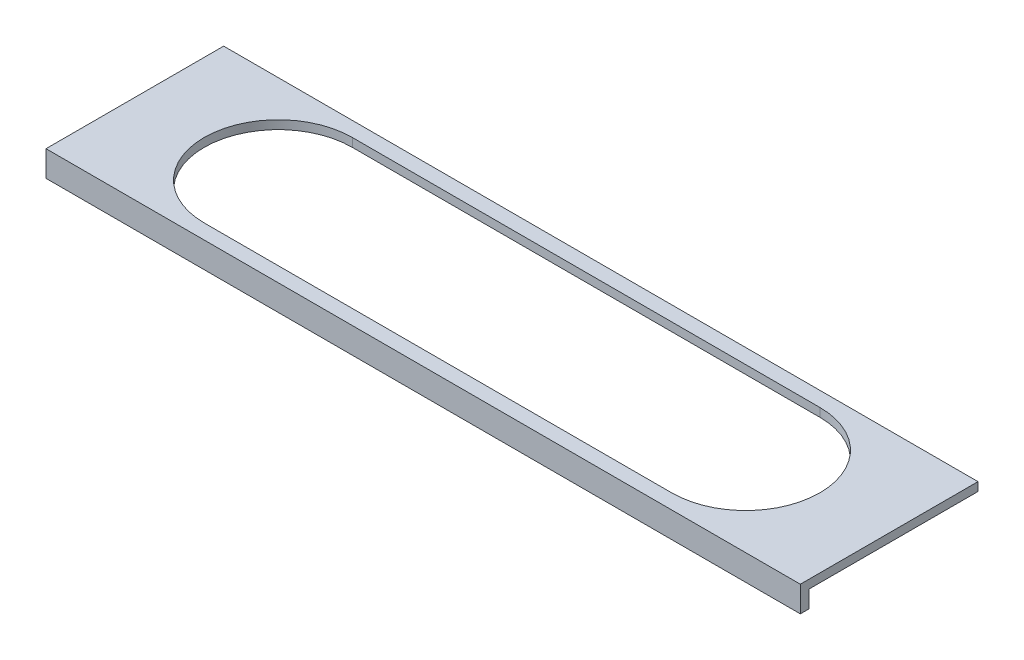
ISO-10303-21;
HEADER;
FILE_DESCRIPTION(('STEP AP214'),'2;1');
FILE_NAME('part.step','',(''),(''),'','','');
FILE_SCHEMA(('AUTOMOTIVE_DESIGN { 1 0 10303 214 1 1 1 1 }'));
ENDSEC;
DATA;
#1=APPLICATION_CONTEXT('core data for automotive mechanical design processes');
#2=APPLICATION_PROTOCOL_DEFINITION('international standard','automotive_design',2000,#1);
#3=PRODUCT_CONTEXT('',#1,'mechanical');
#4=PRODUCT('Part','Part','',(#3));
#5=PRODUCT_RELATED_PRODUCT_CATEGORY('part','',(#4));
#6=PRODUCT_DEFINITION_FORMATION('','',#4);
#7=PRODUCT_DEFINITION_CONTEXT('part definition',#1,'design');
#8=PRODUCT_DEFINITION('design','',#6,#7);
#9=PRODUCT_DEFINITION_SHAPE('','',#8);
#10=(LENGTH_UNIT() NAMED_UNIT(*) SI_UNIT(.MILLI.,.METRE.));
#11=(NAMED_UNIT(*) PLANE_ANGLE_UNIT() SI_UNIT($,.RADIAN.));
#12=(NAMED_UNIT(*) SI_UNIT($,.STERADIAN.) SOLID_ANGLE_UNIT());
#13=UNCERTAINTY_MEASURE_WITH_UNIT(LENGTH_MEASURE(1.E-05),#10,'distance_accuracy_value','');
#14=(GEOMETRIC_REPRESENTATION_CONTEXT(3) GLOBAL_UNCERTAINTY_ASSIGNED_CONTEXT((#13)) GLOBAL_UNIT_ASSIGNED_CONTEXT((#10,
#11,#12)) REPRESENTATION_CONTEXT('',''));
#15=CARTESIAN_POINT('',(0.,0.,0.));
#16=DIRECTION('',(0.,0.,1.));
#17=DIRECTION('',(1.,0.,0.));
#18=AXIS2_PLACEMENT_3D('',#15,#16,#17);
#19=CARTESIAN_POINT('',(0.,0.,0.));
#20=DIRECTION('',(0.,1.,0.));
#21=DIRECTION('',(0.,0.,1.));
#22=AXIS2_PLACEMENT_3D('',#19,#20,#21);
#23=PLANE('',#22);
#24=DIRECTION('',(1.,0.,0.));
#25=VECTOR('',#24,1.);
#26=CARTESIAN_POINT('',(-3000.,0.,949.999999999999));
#27=LINE('',#26,#25);
#28=CARTESIAN_POINT('',(-3000.,0.,949.999999999999));
#29=VERTEX_POINT('',#28);
#30=CARTESIAN_POINT('',(3000.,0.,949.999999999999));
#31=VERTEX_POINT('',#30);
#32=EDGE_CURVE('E173',#29,#31,#27,.T.);
#33=ORIENTED_EDGE('',*,*,#32,.T.);
#34=CARTESIAN_POINT('',(3000.,0.,-7.7715611723761E-13));
#35=DIRECTION('',(0.,1.,0.));
#36=DIRECTION('',(0.,0.,1.));
#37=AXIS2_PLACEMENT_3D('',#34,#35,#36);
#38=CIRCLE('',#37,950.);
#39=CARTESIAN_POINT('',(3000.,0.,-950.));
#40=VERTEX_POINT('',#39);
#41=EDGE_CURVE('E160',#31,#40,#38,.T.);
#42=ORIENTED_EDGE('',*,*,#41,.T.);
#43=DIRECTION('',(-1.,0.,0.));
#44=VECTOR('',#43,1.);
#45=CARTESIAN_POINT('',(-3000.,0.,-950.));
#46=LINE('',#45,#44);
#47=CARTESIAN_POINT('',(-3000.,0.,-950.));
#48=VERTEX_POINT('',#47);
#49=EDGE_CURVE('E164',#40,#48,#46,.T.);
#50=ORIENTED_EDGE('',*,*,#49,.T.);
#51=CARTESIAN_POINT('',(-3000.,0.,-7.7715611723761E-13));
#52=DIRECTION('',(0.,1.,0.));
#53=DIRECTION('',(0.,0.,1.));
#54=AXIS2_PLACEMENT_3D('',#51,#52,#53);
#55=CIRCLE('',#54,950.);
#56=EDGE_CURVE('E169',#48,#29,#55,.T.);
#57=ORIENTED_EDGE('',*,*,#56,.T.);
#58=EDGE_LOOP('',(#33,#42,#50,#57));
#59=FACE_BOUND('',#58,.T.);
#60=DIRECTION('',(1.,0.,0.));
#61=VECTOR('',#60,1.);
#62=CARTESIAN_POINT('',(-4840.,0.,1030.));
#63=LINE('',#62,#61);
#64=CARTESIAN_POINT('',(-4840.,0.,1030.));
#65=VERTEX_POINT('',#64);
#66=CARTESIAN_POINT('',(4840.,0.,1030.));
#67=VERTEX_POINT('',#66);
#68=EDGE_CURVE('E55',#65,#67,#63,.T.);
#69=ORIENTED_EDGE('',*,*,#68,.F.);
#70=DIRECTION('',(0.,0.,1.));
#71=VECTOR('',#70,1.);
#72=CARTESIAN_POINT('',(-4840.,0.,-1140.));
#73=LINE('',#72,#71);
#74=CARTESIAN_POINT('',(-4840.,0.,-1140.));
#75=VERTEX_POINT('',#74);
#76=EDGE_CURVE('E208',#75,#65,#73,.T.);
#77=ORIENTED_EDGE('',*,*,#76,.F.);
#78=DIRECTION('',(-1.,0.,0.));
#79=VECTOR('',#78,1.);
#80=CARTESIAN_POINT('',(-4840.,0.,-1140.));
#81=LINE('',#80,#79);
#82=CARTESIAN_POINT('',(4840.,0.,-1140.));
#83=VERTEX_POINT('',#82);
#84=EDGE_CURVE('E218',#83,#75,#81,.T.);
#85=ORIENTED_EDGE('',*,*,#84,.F.);
#86=DIRECTION('',(0.,0.,-1.));
#87=VECTOR('',#86,1.);
#88=CARTESIAN_POINT('',(4840.,0.,-1140.));
#89=LINE('',#88,#87);
#90=EDGE_CURVE('E194',#67,#83,#89,.T.);
#91=ORIENTED_EDGE('',*,*,#90,.F.);
#92=EDGE_LOOP('',(#69,#77,#85,#91));
#93=FACE_BOUND('',#92,.T.);
#94=ADVANCED_FACE('F39',(#59,#93),#23,.F.);
#95=CARTESIAN_POINT('',(4840.,110.,-1140.));
#96=DIRECTION('',(-1.,0.,0.));
#97=DIRECTION('',(0.,0.,1.));
#98=AXIS2_PLACEMENT_3D('',#95,#96,#97);
#99=PLANE('',#98);
#100=DIRECTION('',(0.,-1.,0.));
#101=VECTOR('',#100,1.);
#102=CARTESIAN_POINT('',(4840.,110.,1140.));
#103=LINE('',#102,#101);
#104=CARTESIAN_POINT('',(4840.,110.,1140.));
#105=VERTEX_POINT('',#104);
#106=CARTESIAN_POINT('',(4840.,-220.,1140.));
#107=VERTEX_POINT('',#106);
#108=EDGE_CURVE('E129',#105,#107,#103,.T.);
#109=ORIENTED_EDGE('',*,*,#108,.T.);
#110=DIRECTION('',(0.,0.,1.));
#111=VECTOR('',#110,1.);
#112=CARTESIAN_POINT('',(4840.,-220.,1030.));
#113=LINE('',#112,#111);
#114=CARTESIAN_POINT('',(4840.,-220.,1030.));
#115=VERTEX_POINT('',#114);
#116=EDGE_CURVE('E144',#115,#107,#113,.T.);
#117=ORIENTED_EDGE('',*,*,#116,.F.);
#118=DIRECTION('',(0.,1.,0.));
#119=VECTOR('',#118,1.);
#120=CARTESIAN_POINT('',(4840.,-220.,1030.));
#121=LINE('',#120,#119);
#122=EDGE_CURVE('E153',#115,#67,#121,.T.);
#123=ORIENTED_EDGE('',*,*,#122,.T.);
#124=ORIENTED_EDGE('',*,*,#90,.T.);
#125=DIRECTION('',(0.,-1.,0.));
#126=VECTOR('',#125,1.);
#127=CARTESIAN_POINT('',(4840.,110.,-1140.));
#128=LINE('',#127,#126);
#129=CARTESIAN_POINT('',(4840.,110.,-1140.));
#130=VERTEX_POINT('',#129);
#131=EDGE_CURVE('E11',#130,#83,#128,.T.);
#132=ORIENTED_EDGE('',*,*,#131,.F.);
#133=DIRECTION('',(0.,0.,-1.));
#134=VECTOR('',#133,1.);
#135=CARTESIAN_POINT('',(4840.,110.,-1140.));
#136=LINE('',#135,#134);
#137=EDGE_CURVE('E203',#105,#130,#136,.T.);
#138=ORIENTED_EDGE('',*,*,#137,.F.);
#139=EDGE_LOOP('',(#109,#117,#123,#124,#132,#138));
#140=FACE_BOUND('',#139,.T.);
#141=ADVANCED_FACE('F41',(#140),#99,.F.);
#142=CARTESIAN_POINT('',(-4840.,110.,-1140.));
#143=DIRECTION('',(0.,0.,1.));
#144=DIRECTION('',(1.,0.,0.));
#145=AXIS2_PLACEMENT_3D('',#142,#143,#144);
#146=PLANE('',#145);
#147=ORIENTED_EDGE('',*,*,#84,.T.);
#148=DIRECTION('',(0.,-1.,0.));
#149=VECTOR('',#148,1.);
#150=CARTESIAN_POINT('',(-4840.,110.,-1140.));
#151=LINE('',#150,#149);
#152=CARTESIAN_POINT('',(-4840.,110.,-1140.));
#153=VERTEX_POINT('',#152);
#154=EDGE_CURVE('E48',#153,#75,#151,.T.);
#155=ORIENTED_EDGE('',*,*,#154,.F.);
#156=DIRECTION('',(-1.,0.,0.));
#157=VECTOR('',#156,1.);
#158=CARTESIAN_POINT('',(-4840.,110.,-1140.));
#159=LINE('',#158,#157);
#160=EDGE_CURVE('E207',#130,#153,#159,.T.);
#161=ORIENTED_EDGE('',*,*,#160,.F.);
#162=ORIENTED_EDGE('',*,*,#131,.T.);
#163=EDGE_LOOP('',(#147,#155,#161,#162));
#164=FACE_BOUND('',#163,.T.);
#165=ADVANCED_FACE('F230',(#164),#146,.F.);
#166=CARTESIAN_POINT('',(-4840.,110.,-1140.));
#167=DIRECTION('',(1.,0.,0.));
#168=DIRECTION('',(0.,0.,-1.));
#169=AXIS2_PLACEMENT_3D('',#166,#167,#168);
#170=PLANE('',#169);
#171=ORIENTED_EDGE('',*,*,#76,.T.);
#172=DIRECTION('',(0.,1.,0.));
#173=VECTOR('',#172,1.);
#174=CARTESIAN_POINT('',(-4840.,-220.,1030.));
#175=LINE('',#174,#173);
#176=CARTESIAN_POINT('',(-4840.,-220.,1030.));
#177=VERTEX_POINT('',#176);
#178=EDGE_CURVE('E135',#177,#65,#175,.T.);
#179=ORIENTED_EDGE('',*,*,#178,.F.);
#180=DIRECTION('',(0.,0.,-1.));
#181=VECTOR('',#180,1.);
#182=CARTESIAN_POINT('',(-4840.,-220.,1140.));
#183=LINE('',#182,#181);
#184=CARTESIAN_POINT('',(-4840.,-220.,1140.));
#185=VERTEX_POINT('',#184);
#186=EDGE_CURVE('E132',#185,#177,#183,.T.);
#187=ORIENTED_EDGE('',*,*,#186,.F.);
#188=DIRECTION('',(0.,-1.,0.));
#189=VECTOR('',#188,1.);
#190=CARTESIAN_POINT('',(-4840.,110.,1140.));
#191=LINE('',#190,#189);
#192=CARTESIAN_POINT('',(-4840.,110.,1140.));
#193=VERTEX_POINT('',#192);
#194=EDGE_CURVE('E119',#193,#185,#191,.T.);
#195=ORIENTED_EDGE('',*,*,#194,.F.);
#196=DIRECTION('',(0.,0.,1.));
#197=VECTOR('',#196,1.);
#198=CARTESIAN_POINT('',(-4840.,110.,-1140.));
#199=LINE('',#198,#197);
#200=EDGE_CURVE('E211',#153,#193,#199,.T.);
#201=ORIENTED_EDGE('',*,*,#200,.F.);
#202=ORIENTED_EDGE('',*,*,#154,.T.);
#203=EDGE_LOOP('',(#171,#179,#187,#195,#201,#202));
#204=FACE_BOUND('',#203,.T.);
#205=ADVANCED_FACE('F133',(#204),#170,.F.);
#206=CARTESIAN_POINT('',(-4840.,110.,1140.));
#207=DIRECTION('',(0.,0.,-1.));
#208=DIRECTION('',(-1.,0.,0.));
#209=AXIS2_PLACEMENT_3D('',#206,#207,#208);
#210=PLANE('',#209);
#211=ORIENTED_EDGE('',*,*,#194,.T.);
#212=DIRECTION('',(-1.,0.,0.));
#213=VECTOR('',#212,1.);
#214=CARTESIAN_POINT('',(4840.,-220.,1140.));
#215=LINE('',#214,#213);
#216=EDGE_CURVE('E124',#107,#185,#215,.T.);
#217=ORIENTED_EDGE('',*,*,#216,.F.);
#218=ORIENTED_EDGE('',*,*,#108,.F.);
#219=DIRECTION('',(1.,0.,0.));
#220=VECTOR('',#219,1.);
#221=CARTESIAN_POINT('',(-4840.,110.,1140.));
#222=LINE('',#221,#220);
#223=EDGE_CURVE('E125',#193,#105,#222,.T.);
#224=ORIENTED_EDGE('',*,*,#223,.F.);
#225=EDGE_LOOP('',(#211,#217,#218,#224));
#226=FACE_BOUND('',#225,.T.);
#227=ADVANCED_FACE('F121',(#226),#210,.F.);
#228=CARTESIAN_POINT('',(0.,110.,0.));
#229=DIRECTION('',(0.,1.,0.));
#230=DIRECTION('',(0.,0.,1.));
#231=AXIS2_PLACEMENT_3D('',#228,#229,#230);
#232=PLANE('',#231);
#233=CARTESIAN_POINT('',(3000.,110.,-7.7715611723761E-13));
#234=DIRECTION('',(0.,1.,0.));
#235=DIRECTION('',(0.,0.,1.));
#236=AXIS2_PLACEMENT_3D('',#233,#234,#235);
#237=CIRCLE('',#236,950.);
#238=CARTESIAN_POINT('',(3000.,110.,949.999999999999));
#239=VERTEX_POINT('',#238);
#240=CARTESIAN_POINT('',(3000.,110.,-950.));
#241=VERTEX_POINT('',#240);
#242=EDGE_CURVE('E63',#239,#241,#237,.T.);
#243=ORIENTED_EDGE('',*,*,#242,.F.);
#244=DIRECTION('',(1.,0.,0.));
#245=VECTOR('',#244,1.);
#246=CARTESIAN_POINT('',(-3000.,110.,949.999999999999));
#247=LINE('',#246,#245);
#248=CARTESIAN_POINT('',(-3000.,110.,949.999999999999));
#249=VERTEX_POINT('',#248);
#250=EDGE_CURVE('E165',#249,#239,#247,.T.);
#251=ORIENTED_EDGE('',*,*,#250,.F.);
#252=CARTESIAN_POINT('',(-3000.,110.,-7.7715611723761E-13));
#253=DIRECTION('',(0.,1.,0.));
#254=DIRECTION('',(0.,0.,1.));
#255=AXIS2_PLACEMENT_3D('',#252,#253,#254);
#256=CIRCLE('',#255,950.);
#257=CARTESIAN_POINT('',(-3000.,110.,-950.000000000001));
#258=VERTEX_POINT('',#257);
#259=EDGE_CURVE('E184',#258,#249,#256,.T.);
#260=ORIENTED_EDGE('',*,*,#259,.F.);
#261=DIRECTION('',(-1.,0.,0.));
#262=VECTOR('',#261,1.);
#263=CARTESIAN_POINT('',(-3000.,110.,-950.));
#264=LINE('',#263,#262);
#265=EDGE_CURVE('E180',#241,#258,#264,.T.);
#266=ORIENTED_EDGE('',*,*,#265,.F.);
#267=EDGE_LOOP('',(#243,#251,#260,#266));
#268=FACE_BOUND('',#267,.T.);
#269=ORIENTED_EDGE('',*,*,#137,.T.);
#270=ORIENTED_EDGE('',*,*,#160,.T.);
#271=ORIENTED_EDGE('',*,*,#200,.T.);
#272=ORIENTED_EDGE('',*,*,#223,.T.);
#273=EDGE_LOOP('',(#269,#270,#271,#272));
#274=FACE_BOUND('',#273,.T.);
#275=ADVANCED_FACE('F256',(#268,#274),#232,.T.);
#276=CARTESIAN_POINT('',(3000.,0.,-7.7715611723761E-13));
#277=DIRECTION('',(0.,1.,0.));
#278=DIRECTION('',(0.,0.,1.));
#279=AXIS2_PLACEMENT_3D('',#276,#277,#278);
#280=CYLINDRICAL_SURFACE('',#279,950.);
#281=ORIENTED_EDGE('',*,*,#242,.T.);
#282=DIRECTION('',(0.,1.,0.));
#283=VECTOR('',#282,1.);
#284=CARTESIAN_POINT('',(3000.,0.,-950.));
#285=LINE('',#284,#283);
#286=EDGE_CURVE('E177',#40,#241,#285,.T.);
#287=ORIENTED_EDGE('',*,*,#286,.F.);
#288=ORIENTED_EDGE('',*,*,#41,.F.);
#289=DIRECTION('',(0.,1.,0.));
#290=VECTOR('',#289,1.);
#291=CARTESIAN_POINT('',(3000.,0.,949.999999999999));
#292=LINE('',#291,#290);
#293=EDGE_CURVE('E191',#31,#239,#292,.T.);
#294=ORIENTED_EDGE('',*,*,#293,.T.);
#295=EDGE_LOOP('',(#281,#287,#288,#294));
#296=FACE_BOUND('',#295,.T.);
#297=ADVANCED_FACE('F280',(#296),#280,.F.);
#298=CARTESIAN_POINT('',(-3000.,0.,949.999999999999));
#299=DIRECTION('',(0.,0.,1.));
#300=DIRECTION('',(1.,0.,0.));
#301=AXIS2_PLACEMENT_3D('',#298,#299,#300);
#302=PLANE('',#301);
#303=ORIENTED_EDGE('',*,*,#250,.T.);
#304=ORIENTED_EDGE('',*,*,#293,.F.);
#305=ORIENTED_EDGE('',*,*,#32,.F.);
#306=DIRECTION('',(0.,1.,0.));
#307=VECTOR('',#306,1.);
#308=CARTESIAN_POINT('',(-3000.,0.,949.999999999999));
#309=LINE('',#308,#307);
#310=EDGE_CURVE('E195',#29,#249,#309,.T.);
#311=ORIENTED_EDGE('',*,*,#310,.T.);
#312=EDGE_LOOP('',(#303,#304,#305,#311));
#313=FACE_BOUND('',#312,.T.);
#314=ADVANCED_FACE('F287',(#313),#302,.F.);
#315=CARTESIAN_POINT('',(-3000.,0.,-7.7715611723761E-13));
#316=DIRECTION('',(0.,1.,0.));
#317=DIRECTION('',(0.,0.,1.));
#318=AXIS2_PLACEMENT_3D('',#315,#316,#317);
#319=CYLINDRICAL_SURFACE('',#318,950.);
#320=ORIENTED_EDGE('',*,*,#259,.T.);
#321=ORIENTED_EDGE('',*,*,#310,.F.);
#322=ORIENTED_EDGE('',*,*,#56,.F.);
#323=DIRECTION('',(0.,1.,0.));
#324=VECTOR('',#323,1.);
#325=CARTESIAN_POINT('',(-3000.,0.,-950.000000000001));
#326=LINE('',#325,#324);
#327=EDGE_CURVE('E198',#48,#258,#326,.T.);
#328=ORIENTED_EDGE('',*,*,#327,.T.);
#329=EDGE_LOOP('',(#320,#321,#322,#328));
#330=FACE_BOUND('',#329,.T.);
#331=ADVANCED_FACE('F244',(#330),#319,.F.);
#332=CARTESIAN_POINT('',(-3000.,0.,-950.));
#333=DIRECTION('',(0.,0.,-1.));
#334=DIRECTION('',(-1.,0.,0.));
#335=AXIS2_PLACEMENT_3D('',#332,#333,#334);
#336=PLANE('',#335);
#337=ORIENTED_EDGE('',*,*,#265,.T.);
#338=ORIENTED_EDGE('',*,*,#327,.F.);
#339=ORIENTED_EDGE('',*,*,#49,.F.);
#340=ORIENTED_EDGE('',*,*,#286,.T.);
#341=EDGE_LOOP('',(#337,#338,#339,#340));
#342=FACE_BOUND('',#341,.T.);
#343=ADVANCED_FACE('F237',(#342),#336,.F.);
#344=CARTESIAN_POINT('',(-4840.,-220.,1030.));
#345=DIRECTION('',(0.,0.,1.));
#346=DIRECTION('',(1.,0.,0.));
#347=AXIS2_PLACEMENT_3D('',#344,#345,#346);
#348=PLANE('',#347);
#349=ORIENTED_EDGE('',*,*,#68,.T.);
#350=ORIENTED_EDGE('',*,*,#122,.F.);
#351=DIRECTION('',(1.,0.,0.));
#352=VECTOR('',#351,1.);
#353=CARTESIAN_POINT('',(-4840.,-220.,1030.));
#354=LINE('',#353,#352);
#355=EDGE_CURVE('E139',#177,#115,#354,.T.);
#356=ORIENTED_EDGE('',*,*,#355,.F.);
#357=ORIENTED_EDGE('',*,*,#178,.T.);
#358=EDGE_LOOP('',(#349,#350,#356,#357));
#359=FACE_BOUND('',#358,.T.);
#360=ADVANCED_FACE('F235',(#359),#348,.F.);
#361=CARTESIAN_POINT('',(0.,-220.,0.));
#362=DIRECTION('',(0.,-1.,0.));
#363=DIRECTION('',(0.,0.,-1.));
#364=AXIS2_PLACEMENT_3D('',#361,#362,#363);
#365=PLANE('',#364);
#366=ORIENTED_EDGE('',*,*,#216,.T.);
#367=ORIENTED_EDGE('',*,*,#186,.T.);
#368=ORIENTED_EDGE('',*,*,#355,.T.);
#369=ORIENTED_EDGE('',*,*,#116,.T.);
#370=EDGE_LOOP('',(#366,#367,#368,#369));
#371=FACE_BOUND('',#370,.T.);
#372=ADVANCED_FACE('F142',(#371),#365,.T.);
#373=CLOSED_SHELL('',(#94,#141,#165,#205,#227,#275,#297,#314,#331,#343,#360,#372));
#374=MANIFOLD_SOLID_BREP('B2',#373);
#375=ADVANCED_BREP_SHAPE_REPRESENTATION('',(#18,#374),#14);
#376=SHAPE_DEFINITION_REPRESENTATION(#9,#375);
ENDSEC;
END-ISO-10303-21;
